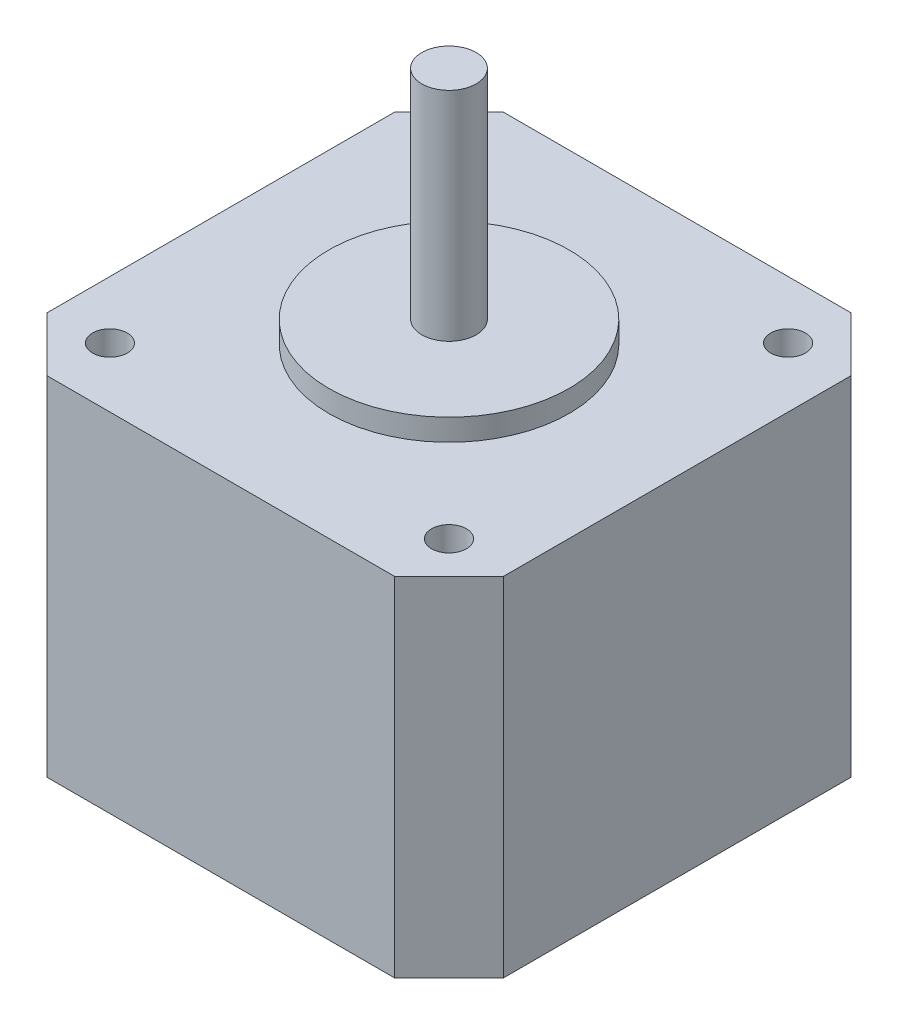
ISO-10303-21;
HEADER;
FILE_DESCRIPTION(('STEP AP214'),'2;1');
FILE_NAME('part.step','',(''),(''),'','','');
FILE_SCHEMA(('AUTOMOTIVE_DESIGN { 1 0 10303 214 1 1 1 1 }'));
ENDSEC;
DATA;
#1=APPLICATION_CONTEXT('core data for automotive mechanical design processes');
#2=APPLICATION_PROTOCOL_DEFINITION('international standard','automotive_design',2000,#1);
#3=PRODUCT_CONTEXT('',#1,'mechanical');
#4=PRODUCT('Part','Part','',(#3));
#5=PRODUCT_RELATED_PRODUCT_CATEGORY('part','',(#4));
#6=PRODUCT_DEFINITION_FORMATION('','',#4);
#7=PRODUCT_DEFINITION_CONTEXT('part definition',#1,'design');
#8=PRODUCT_DEFINITION('design','',#6,#7);
#9=PRODUCT_DEFINITION_SHAPE('','',#8);
#10=(LENGTH_UNIT() NAMED_UNIT(*) SI_UNIT(.MILLI.,.METRE.));
#11=(NAMED_UNIT(*) PLANE_ANGLE_UNIT() SI_UNIT($,.RADIAN.));
#12=(NAMED_UNIT(*) SI_UNIT($,.STERADIAN.) SOLID_ANGLE_UNIT());
#13=UNCERTAINTY_MEASURE_WITH_UNIT(LENGTH_MEASURE(1.E-05),#10,'distance_accuracy_value','');
#14=(GEOMETRIC_REPRESENTATION_CONTEXT(3) GLOBAL_UNCERTAINTY_ASSIGNED_CONTEXT((#13)) GLOBAL_UNIT_ASSIGNED_CONTEXT((#10,
#11,#12)) REPRESENTATION_CONTEXT('',''));
#15=CARTESIAN_POINT('',(0.,0.,0.));
#16=DIRECTION('',(0.,0.,1.));
#17=DIRECTION('',(1.,0.,0.));
#18=AXIS2_PLACEMENT_3D('',#15,#16,#17);
#19=CARTESIAN_POINT('',(21.,32.,21.));
#20=DIRECTION('',(-1.,0.,0.));
#21=DIRECTION('',(0.,0.,1.));
#22=AXIS2_PLACEMENT_3D('',#19,#20,#21);
#23=PLANE('',#22);
#24=DIRECTION('',(0.,0.,-1.));
#25=VECTOR('',#24,1.);
#26=CARTESIAN_POINT('',(21.,0.,21.));
#27=LINE('',#26,#25);
#28=CARTESIAN_POINT('',(21.,0.,16.));
#29=VERTEX_POINT('',#28);
#30=CARTESIAN_POINT('',(21.,0.,-16.));
#31=VERTEX_POINT('',#30);
#32=EDGE_CURVE('E134',#29,#31,#27,.T.);
#33=ORIENTED_EDGE('',*,*,#32,.T.);
#34=DIRECTION('',(0.,1.,0.));
#35=VECTOR('',#34,1.);
#36=CARTESIAN_POINT('',(21.,32.,-16.));
#37=LINE('',#36,#35);
#38=CARTESIAN_POINT('',(21.,32.,-16.));
#39=VERTEX_POINT('',#38);
#40=EDGE_CURVE('E157',#31,#39,#37,.T.);
#41=ORIENTED_EDGE('',*,*,#40,.T.);
#42=DIRECTION('',(0.,0.,-1.));
#43=VECTOR('',#42,1.);
#44=CARTESIAN_POINT('',(21.,32.,21.));
#45=LINE('',#44,#43);
#46=CARTESIAN_POINT('',(21.,32.,16.));
#47=VERTEX_POINT('',#46);
#48=EDGE_CURVE('E132',#47,#39,#45,.T.);
#49=ORIENTED_EDGE('',*,*,#48,.F.);
#50=DIRECTION('',(0.,-1.,0.));
#51=VECTOR('',#50,1.);
#52=CARTESIAN_POINT('',(21.,32.,16.));
#53=LINE('',#52,#51);
#54=EDGE_CURVE('E154',#47,#29,#53,.T.);
#55=ORIENTED_EDGE('',*,*,#54,.T.);
#56=EDGE_LOOP('',(#33,#41,#49,#55));
#57=FACE_BOUND('',#56,.T.);
#58=ADVANCED_FACE('F35',(#57),#23,.F.);
#59=CARTESIAN_POINT('',(-21.,32.,-21.));
#60=DIRECTION('',(0.,0.,1.));
#61=DIRECTION('',(1.,0.,0.));
#62=AXIS2_PLACEMENT_3D('',#59,#60,#61);
#63=PLANE('',#62);
#64=DIRECTION('',(-1.,0.,0.));
#65=VECTOR('',#64,1.);
#66=CARTESIAN_POINT('',(-21.,0.,-21.));
#67=LINE('',#66,#65);
#68=CARTESIAN_POINT('',(16.,0.,-21.));
#69=VERTEX_POINT('',#68);
#70=CARTESIAN_POINT('',(-16.,0.,-21.));
#71=VERTEX_POINT('',#70);
#72=EDGE_CURVE('E130',#69,#71,#67,.T.);
#73=ORIENTED_EDGE('',*,*,#72,.T.);
#74=DIRECTION('',(0.,1.,0.));
#75=VECTOR('',#74,1.);
#76=CARTESIAN_POINT('',(-16.,32.,-21.));
#77=LINE('',#76,#75);
#78=CARTESIAN_POINT('',(-16.,32.,-21.));
#79=VERTEX_POINT('',#78);
#80=EDGE_CURVE('E109',#71,#79,#77,.T.);
#81=ORIENTED_EDGE('',*,*,#80,.T.);
#82=DIRECTION('',(-1.,0.,0.));
#83=VECTOR('',#82,1.);
#84=CARTESIAN_POINT('',(-21.,32.,-21.));
#85=LINE('',#84,#83);
#86=CARTESIAN_POINT('',(16.,32.,-21.));
#87=VERTEX_POINT('',#86);
#88=EDGE_CURVE('E170',#87,#79,#85,.T.);
#89=ORIENTED_EDGE('',*,*,#88,.F.);
#90=DIRECTION('',(0.,-1.,0.));
#91=VECTOR('',#90,1.);
#92=CARTESIAN_POINT('',(16.,32.,-21.));
#93=LINE('',#92,#91);
#94=EDGE_CURVE('E114',#87,#69,#93,.T.);
#95=ORIENTED_EDGE('',*,*,#94,.T.);
#96=EDGE_LOOP('',(#73,#81,#89,#95));
#97=FACE_BOUND('',#96,.T.);
#98=ADVANCED_FACE('F233',(#97),#63,.F.);
#99=CARTESIAN_POINT('',(-21.,32.,21.));
#100=DIRECTION('',(1.,0.,0.));
#101=DIRECTION('',(0.,0.,-1.));
#102=AXIS2_PLACEMENT_3D('',#99,#100,#101);
#103=PLANE('',#102);
#104=DIRECTION('',(0.,0.,1.));
#105=VECTOR('',#104,1.);
#106=CARTESIAN_POINT('',(-21.,32.,21.));
#107=LINE('',#106,#105);
#108=CARTESIAN_POINT('',(-21.,32.,-16.));
#109=VERTEX_POINT('',#108);
#110=CARTESIAN_POINT('',(-21.,32.,16.));
#111=VERTEX_POINT('',#110);
#112=EDGE_CURVE('E123',#109,#111,#107,.T.);
#113=ORIENTED_EDGE('',*,*,#112,.F.);
#114=DIRECTION('',(0.,-1.,0.));
#115=VECTOR('',#114,1.);
#116=CARTESIAN_POINT('',(-21.,32.,-16.));
#117=LINE('',#116,#115);
#118=CARTESIAN_POINT('',(-21.,0.,-16.));
#119=VERTEX_POINT('',#118);
#120=EDGE_CURVE('E108',#109,#119,#117,.T.);
#121=ORIENTED_EDGE('',*,*,#120,.T.);
#122=DIRECTION('',(0.,0.,1.));
#123=VECTOR('',#122,1.);
#124=CARTESIAN_POINT('',(-21.,0.,21.));
#125=LINE('',#124,#123);
#126=CARTESIAN_POINT('',(-21.,0.,16.));
#127=VERTEX_POINT('',#126);
#128=EDGE_CURVE('E121',#119,#127,#125,.T.);
#129=ORIENTED_EDGE('',*,*,#128,.T.);
#130=DIRECTION('',(0.,1.,0.));
#131=VECTOR('',#130,1.);
#132=CARTESIAN_POINT('',(-21.,32.,16.));
#133=LINE('',#132,#131);
#134=EDGE_CURVE('E125',#127,#111,#133,.T.);
#135=ORIENTED_EDGE('',*,*,#134,.T.);
#136=EDGE_LOOP('',(#113,#121,#129,#135));
#137=FACE_BOUND('',#136,.T.);
#138=ADVANCED_FACE('F120',(#137),#103,.F.);
#139=CARTESIAN_POINT('',(-21.,32.,21.));
#140=DIRECTION('',(0.,0.,-1.));
#141=DIRECTION('',(-1.,0.,0.));
#142=AXIS2_PLACEMENT_3D('',#139,#140,#141);
#143=PLANE('',#142);
#144=DIRECTION('',(1.,0.,0.));
#145=VECTOR('',#144,1.);
#146=CARTESIAN_POINT('',(-21.,0.,21.));
#147=LINE('',#146,#145);
#148=CARTESIAN_POINT('',(-16.,0.,21.));
#149=VERTEX_POINT('',#148);
#150=CARTESIAN_POINT('',(16.,0.,21.));
#151=VERTEX_POINT('',#150);
#152=EDGE_CURVE('E129',#149,#151,#147,.T.);
#153=ORIENTED_EDGE('',*,*,#152,.T.);
#154=DIRECTION('',(0.,1.,0.));
#155=VECTOR('',#154,1.);
#156=CARTESIAN_POINT('',(16.,32.,21.));
#157=LINE('',#156,#155);
#158=CARTESIAN_POINT('',(16.,32.,21.));
#159=VERTEX_POINT('',#158);
#160=EDGE_CURVE('E40',#151,#159,#157,.T.);
#161=ORIENTED_EDGE('',*,*,#160,.T.);
#162=DIRECTION('',(1.,0.,0.));
#163=VECTOR('',#162,1.);
#164=CARTESIAN_POINT('',(-21.,32.,21.));
#165=LINE('',#164,#163);
#166=CARTESIAN_POINT('',(-16.,32.,21.));
#167=VERTEX_POINT('',#166);
#168=EDGE_CURVE('E138',#167,#159,#165,.T.);
#169=ORIENTED_EDGE('',*,*,#168,.F.);
#170=DIRECTION('',(0.,-1.,0.));
#171=VECTOR('',#170,1.);
#172=CARTESIAN_POINT('',(-16.,32.,21.));
#173=LINE('',#172,#171);
#174=EDGE_CURVE('E158',#167,#149,#173,.T.);
#175=ORIENTED_EDGE('',*,*,#174,.T.);
#176=EDGE_LOOP('',(#153,#161,#169,#175));
#177=FACE_BOUND('',#176,.T.);
#178=ADVANCED_FACE('F224',(#177),#143,.F.);
#179=CARTESIAN_POINT('',(0.,32.,0.));
#180=DIRECTION('',(0.,-1.,0.));
#181=DIRECTION('',(0.,0.,-1.));
#182=AXIS2_PLACEMENT_3D('',#179,#180,#181);
#183=PLANE('',#182);
#184=CARTESIAN_POINT('',(-15.6999999999997,32.,15.5));
#185=DIRECTION('',(0.,1.,0.));
#186=DIRECTION('',(0.,0.,1.));
#187=AXIS2_PLACEMENT_3D('',#184,#185,#186);
#188=CIRCLE('',#187,1.6);
#189=CARTESIAN_POINT('',(-15.6999999999997,32.,17.1));
#190=VERTEX_POINT('',#189);
#191=EDGE_CURVE('E194',#190,#190,#188,.T.);
#192=ORIENTED_EDGE('',*,*,#191,.F.);
#193=EDGE_LOOP('',(#192));
#194=FACE_BOUND('',#193,.T.);
#195=CARTESIAN_POINT('',(15.5000000000003,32.,15.5));
#196=DIRECTION('',(0.,1.,0.));
#197=DIRECTION('',(0.,0.,1.));
#198=AXIS2_PLACEMENT_3D('',#195,#196,#197);
#199=CIRCLE('',#198,1.6);
#200=CARTESIAN_POINT('',(15.5000000000003,32.,17.1));
#201=VERTEX_POINT('',#200);
#202=EDGE_CURVE('E200',#201,#201,#199,.T.);
#203=ORIENTED_EDGE('',*,*,#202,.F.);
#204=EDGE_LOOP('',(#203));
#205=FACE_BOUND('',#204,.T.);
#206=CARTESIAN_POINT('',(15.5,32.,-15.7));
#207=DIRECTION('',(0.,1.,0.));
#208=DIRECTION('',(0.,0.,1.));
#209=AXIS2_PLACEMENT_3D('',#206,#207,#208);
#210=CIRCLE('',#209,1.6);
#211=CARTESIAN_POINT('',(15.5,32.,-14.1));
#212=VERTEX_POINT('',#211);
#213=EDGE_CURVE('E206',#212,#212,#210,.T.);
#214=ORIENTED_EDGE('',*,*,#213,.F.);
#215=EDGE_LOOP('',(#214));
#216=FACE_BOUND('',#215,.T.);
#217=CARTESIAN_POINT('',(-15.7,32.,-15.7));
#218=DIRECTION('',(0.,1.,0.));
#219=DIRECTION('',(0.,0.,1.));
#220=AXIS2_PLACEMENT_3D('',#217,#218,#219);
#221=CIRCLE('',#220,1.6);
#222=CARTESIAN_POINT('',(-15.7,32.,-14.1));
#223=VERTEX_POINT('',#222);
#224=EDGE_CURVE('E188',#223,#223,#221,.T.);
#225=ORIENTED_EDGE('',*,*,#224,.F.);
#226=EDGE_LOOP('',(#225));
#227=FACE_BOUND('',#226,.T.);
#228=CARTESIAN_POINT('',(0.,32.,0.));
#229=DIRECTION('',(0.,1.,0.));
#230=DIRECTION('',(0.,0.,1.));
#231=AXIS2_PLACEMENT_3D('',#228,#229,#230);
#232=CIRCLE('',#231,11.05);
#233=CARTESIAN_POINT('',(0.,32.,11.05));
#234=VERTEX_POINT('',#233);
#235=EDGE_CURVE('E45',#234,#234,#232,.T.);
#236=ORIENTED_EDGE('',*,*,#235,.F.);
#237=EDGE_LOOP('',(#236));
#238=FACE_BOUND('',#237,.T.);
#239=ORIENTED_EDGE('',*,*,#88,.T.);
#240=DIRECTION('',(0.707106781186549,0.,-0.707106781186547));
#241=VECTOR('',#240,1.);
#242=CARTESIAN_POINT('',(-21.,32.,-16.));
#243=LINE('',#242,#241);
#244=EDGE_CURVE('E152',#79,#109,#243,.F.);
#245=ORIENTED_EDGE('',*,*,#244,.T.);
#246=ORIENTED_EDGE('',*,*,#112,.T.);
#247=DIRECTION('',(-0.707106781186546,0.,-0.707106781186549));
#248=VECTOR('',#247,1.);
#249=CARTESIAN_POINT('',(-16.,32.,21.));
#250=LINE('',#249,#248);
#251=EDGE_CURVE('E59',#111,#167,#250,.F.);
#252=ORIENTED_EDGE('',*,*,#251,.T.);
#253=ORIENTED_EDGE('',*,*,#168,.T.);
#254=DIRECTION('',(-0.707106781186549,0.,0.707106781186547));
#255=VECTOR('',#254,1.);
#256=CARTESIAN_POINT('',(21.,32.,16.));
#257=LINE('',#256,#255);
#258=EDGE_CURVE('E148',#159,#47,#257,.F.);
#259=ORIENTED_EDGE('',*,*,#258,.T.);
#260=ORIENTED_EDGE('',*,*,#48,.T.);
#261=DIRECTION('',(0.707106781186546,0.,0.707106781186549));
#262=VECTOR('',#261,1.);
#263=CARTESIAN_POINT('',(16.,32.,-21.));
#264=LINE('',#263,#262);
#265=EDGE_CURVE('E150',#39,#87,#264,.F.);
#266=ORIENTED_EDGE('',*,*,#265,.T.);
#267=EDGE_LOOP('',(#239,#245,#246,#252,#253,#259,#260,#266));
#268=FACE_BOUND('',#267,.T.);
#269=ADVANCED_FACE('F221',(#194,#205,#216,#227,#238,#268),#183,.F.);
#270=CARTESIAN_POINT('',(0.,0.,0.));
#271=DIRECTION('',(0.,-1.,0.));
#272=DIRECTION('',(0.,0.,-1.));
#273=AXIS2_PLACEMENT_3D('',#270,#271,#272);
#274=PLANE('',#273);
#275=ORIENTED_EDGE('',*,*,#128,.F.);
#276=DIRECTION('',(-0.707106781186549,0.,0.707106781186547));
#277=VECTOR('',#276,1.);
#278=CARTESIAN_POINT('',(-18.5,0.,-18.5));
#279=LINE('',#278,#277);
#280=EDGE_CURVE('E104',#119,#71,#279,.F.);
#281=ORIENTED_EDGE('',*,*,#280,.T.);
#282=ORIENTED_EDGE('',*,*,#72,.F.);
#283=DIRECTION('',(-0.707106781186546,0.,-0.707106781186549));
#284=VECTOR('',#283,1.);
#285=CARTESIAN_POINT('',(18.5,0.,-18.5));
#286=LINE('',#285,#284);
#287=EDGE_CURVE('E115',#69,#31,#286,.F.);
#288=ORIENTED_EDGE('',*,*,#287,.T.);
#289=ORIENTED_EDGE('',*,*,#32,.F.);
#290=DIRECTION('',(0.707106781186549,0.,-0.707106781186547));
#291=VECTOR('',#290,1.);
#292=CARTESIAN_POINT('',(18.5,0.,18.5));
#293=LINE('',#292,#291);
#294=EDGE_CURVE('E141',#29,#151,#293,.F.);
#295=ORIENTED_EDGE('',*,*,#294,.T.);
#296=ORIENTED_EDGE('',*,*,#152,.F.);
#297=DIRECTION('',(0.707106781186546,0.,0.707106781186549));
#298=VECTOR('',#297,1.);
#299=CARTESIAN_POINT('',(-18.5,0.,18.5));
#300=LINE('',#299,#298);
#301=EDGE_CURVE('E124',#149,#127,#300,.F.);
#302=ORIENTED_EDGE('',*,*,#301,.T.);
#303=EDGE_LOOP('',(#275,#281,#282,#288,#289,#295,#296,#302));
#304=FACE_BOUND('',#303,.T.);
#305=ADVANCED_FACE('F127',(#304),#274,.T.);
#306=CARTESIAN_POINT('',(-21.,32.,-16.));
#307=DIRECTION('',(0.707106781186547,0.,0.707106781186549));
#308=DIRECTION('',(0.,-1.,0.));
#309=AXIS2_PLACEMENT_3D('',#306,#307,#308);
#310=PLANE('',#309);
#311=ORIENTED_EDGE('',*,*,#244,.F.);
#312=ORIENTED_EDGE('',*,*,#80,.F.);
#313=ORIENTED_EDGE('',*,*,#280,.F.);
#314=ORIENTED_EDGE('',*,*,#120,.F.);
#315=EDGE_LOOP('',(#311,#312,#313,#314));
#316=FACE_BOUND('',#315,.T.);
#317=ADVANCED_FACE('F107',(#316),#310,.F.);
#318=CARTESIAN_POINT('',(16.,32.,-21.));
#319=DIRECTION('',(-0.707106781186549,0.,0.707106781186546));
#320=DIRECTION('',(0.,-1.,0.));
#321=AXIS2_PLACEMENT_3D('',#318,#319,#320);
#322=PLANE('',#321);
#323=ORIENTED_EDGE('',*,*,#265,.F.);
#324=ORIENTED_EDGE('',*,*,#40,.F.);
#325=ORIENTED_EDGE('',*,*,#287,.F.);
#326=ORIENTED_EDGE('',*,*,#94,.F.);
#327=EDGE_LOOP('',(#323,#324,#325,#326));
#328=FACE_BOUND('',#327,.T.);
#329=ADVANCED_FACE('F235',(#328),#322,.F.);
#330=CARTESIAN_POINT('',(21.,32.,16.));
#331=DIRECTION('',(-0.707106781186546,0.,-0.707106781186548));
#332=DIRECTION('',(0.,-1.,0.));
#333=AXIS2_PLACEMENT_3D('',#330,#331,#332);
#334=PLANE('',#333);
#335=ORIENTED_EDGE('',*,*,#258,.F.);
#336=ORIENTED_EDGE('',*,*,#160,.F.);
#337=ORIENTED_EDGE('',*,*,#294,.F.);
#338=ORIENTED_EDGE('',*,*,#54,.F.);
#339=EDGE_LOOP('',(#335,#336,#337,#338));
#340=FACE_BOUND('',#339,.T.);
#341=ADVANCED_FACE('F239',(#340),#334,.F.);
#342=CARTESIAN_POINT('',(-16.,32.,21.));
#343=DIRECTION('',(0.707106781186549,0.,-0.707106781186546));
#344=DIRECTION('',(0.,-1.,0.));
#345=AXIS2_PLACEMENT_3D('',#342,#343,#344);
#346=PLANE('',#345);
#347=ORIENTED_EDGE('',*,*,#251,.F.);
#348=ORIENTED_EDGE('',*,*,#134,.F.);
#349=ORIENTED_EDGE('',*,*,#301,.F.);
#350=ORIENTED_EDGE('',*,*,#174,.F.);
#351=EDGE_LOOP('',(#347,#348,#349,#350));
#352=FACE_BOUND('',#351,.T.);
#353=ADVANCED_FACE('F38',(#352),#346,.F.);
#354=CARTESIAN_POINT('',(0.,34.,0.));
#355=DIRECTION('',(0.,-1.,0.));
#356=DIRECTION('',(0.,0.,-1.));
#357=AXIS2_PLACEMENT_3D('',#354,#355,#356);
#358=CYLINDRICAL_SURFACE('',#357,11.05);
#359=CARTESIAN_POINT('',(0.,34.,0.));
#360=DIRECTION('',(0.,1.,0.));
#361=DIRECTION('',(0.,0.,1.));
#362=AXIS2_PLACEMENT_3D('',#359,#360,#361);
#363=CIRCLE('',#362,11.05);
#364=CARTESIAN_POINT('',(0.,34.,11.05));
#365=VERTEX_POINT('',#364);
#366=EDGE_CURVE('E167',#365,#365,#363,.T.);
#367=ORIENTED_EDGE('',*,*,#366,.F.);
#368=EDGE_LOOP('',(#367));
#369=FACE_BOUND('',#368,.T.);
#370=ORIENTED_EDGE('',*,*,#235,.T.);
#371=EDGE_LOOP('',(#370));
#372=FACE_BOUND('',#371,.T.);
#373=ADVANCED_FACE('F265',(#369,#372),#358,.T.);
#374=CARTESIAN_POINT('',(0.,34.,0.));
#375=DIRECTION('',(0.,1.,0.));
#376=DIRECTION('',(0.,0.,1.));
#377=AXIS2_PLACEMENT_3D('',#374,#375,#376);
#378=PLANE('',#377);
#379=CARTESIAN_POINT('',(0.,34.,0.));
#380=DIRECTION('',(0.,1.,0.));
#381=DIRECTION('',(0.,0.,1.));
#382=AXIS2_PLACEMENT_3D('',#379,#380,#381);
#383=CIRCLE('',#382,2.5);
#384=CARTESIAN_POINT('',(0.,34.,2.5));
#385=VERTEX_POINT('',#384);
#386=EDGE_CURVE('E11',#385,#385,#383,.T.);
#387=ORIENTED_EDGE('',*,*,#386,.F.);
#388=EDGE_LOOP('',(#387));
#389=FACE_BOUND('',#388,.T.);
#390=ORIENTED_EDGE('',*,*,#366,.T.);
#391=EDGE_LOOP('',(#390));
#392=FACE_BOUND('',#391,.T.);
#393=ADVANCED_FACE('F270',(#389,#392),#378,.T.);
#394=CARTESIAN_POINT('',(0.,54.,0.));
#395=DIRECTION('',(0.,-1.,0.));
#396=DIRECTION('',(0.,0.,-1.));
#397=AXIS2_PLACEMENT_3D('',#394,#395,#396);
#398=CYLINDRICAL_SURFACE('',#397,2.5);
#399=CARTESIAN_POINT('',(0.,54.,0.));
#400=DIRECTION('',(0.,1.,0.));
#401=DIRECTION('',(0.,0.,1.));
#402=AXIS2_PLACEMENT_3D('',#399,#400,#401);
#403=CIRCLE('',#402,2.5);
#404=CARTESIAN_POINT('',(0.,54.,2.5));
#405=VERTEX_POINT('',#404);
#406=EDGE_CURVE('E179',#405,#405,#403,.T.);
#407=ORIENTED_EDGE('',*,*,#406,.F.);
#408=EDGE_LOOP('',(#407));
#409=FACE_BOUND('',#408,.T.);
#410=ORIENTED_EDGE('',*,*,#386,.T.);
#411=EDGE_LOOP('',(#410));
#412=FACE_BOUND('',#411,.T.);
#413=ADVANCED_FACE('F276',(#409,#412),#398,.T.);
#414=CARTESIAN_POINT('',(0.,54.,0.));
#415=DIRECTION('',(0.,1.,0.));
#416=DIRECTION('',(0.,0.,1.));
#417=AXIS2_PLACEMENT_3D('',#414,#415,#416);
#418=PLANE('',#417);
#419=ORIENTED_EDGE('',*,*,#406,.T.);
#420=EDGE_LOOP('',(#419));
#421=FACE_BOUND('',#420,.T.);
#422=ADVANCED_FACE('F339',(#421),#418,.T.);
#423=CARTESIAN_POINT('',(-15.7,27.,-15.7));
#424=DIRECTION('',(0.,1.,0.));
#425=DIRECTION('',(0.,0.,1.));
#426=AXIS2_PLACEMENT_3D('',#423,#424,#425);
#427=CYLINDRICAL_SURFACE('',#426,1.6);
#428=CARTESIAN_POINT('',(-15.7,27.,-15.7));
#429=DIRECTION('',(0.,1.,0.));
#430=DIRECTION('',(0.,0.,1.));
#431=AXIS2_PLACEMENT_3D('',#428,#429,#430);
#432=CIRCLE('',#431,1.6);
#433=CARTESIAN_POINT('',(-15.7,27.,-14.1));
#434=VERTEX_POINT('',#433);
#435=EDGE_CURVE('E183',#434,#434,#432,.T.);
#436=ORIENTED_EDGE('',*,*,#435,.F.);
#437=EDGE_LOOP('',(#436));
#438=FACE_BOUND('',#437,.T.);
#439=ORIENTED_EDGE('',*,*,#224,.T.);
#440=EDGE_LOOP('',(#439));
#441=FACE_BOUND('',#440,.T.);
#442=ADVANCED_FACE('F347',(#438,#441),#427,.F.);
#443=CARTESIAN_POINT('',(-15.7,27.,-15.7));
#444=DIRECTION('',(0.,1.,0.));
#445=DIRECTION('',(0.,0.,1.));
#446=AXIS2_PLACEMENT_3D('',#443,#444,#445);
#447=PLANE('',#446);
#448=ORIENTED_EDGE('',*,*,#435,.T.);
#449=EDGE_LOOP('',(#448));
#450=FACE_BOUND('',#449,.T.);
#451=ADVANCED_FACE('F217',(#450),#447,.T.);
#452=CARTESIAN_POINT('',(15.5,27.,-15.7));
#453=DIRECTION('',(0.,1.,0.));
#454=DIRECTION('',(0.,0.,1.));
#455=AXIS2_PLACEMENT_3D('',#452,#453,#454);
#456=CYLINDRICAL_SURFACE('',#455,1.6);
#457=CARTESIAN_POINT('',(15.5,27.,-15.7));
#458=DIRECTION('',(0.,1.,0.));
#459=DIRECTION('',(0.,0.,1.));
#460=AXIS2_PLACEMENT_3D('',#457,#458,#459);
#461=CIRCLE('',#460,1.6);
#462=CARTESIAN_POINT('',(15.5,27.,-14.1));
#463=VERTEX_POINT('',#462);
#464=EDGE_CURVE('E192',#463,#463,#461,.T.);
#465=ORIENTED_EDGE('',*,*,#464,.F.);
#466=EDGE_LOOP('',(#465));
#467=FACE_BOUND('',#466,.T.);
#468=ORIENTED_EDGE('',*,*,#213,.T.);
#469=EDGE_LOOP('',(#468));
#470=FACE_BOUND('',#469,.T.);
#471=ADVANCED_FACE('F214',(#467,#470),#456,.F.);
#472=CARTESIAN_POINT('',(15.5,27.,-15.7));
#473=DIRECTION('',(0.,1.,0.));
#474=DIRECTION('',(0.,0.,1.));
#475=AXIS2_PLACEMENT_3D('',#472,#473,#474);
#476=PLANE('',#475);
#477=ORIENTED_EDGE('',*,*,#464,.T.);
#478=EDGE_LOOP('',(#477));
#479=FACE_BOUND('',#478,.T.);
#480=ADVANCED_FACE('F212',(#479),#476,.T.);
#481=CARTESIAN_POINT('',(15.5000000000003,27.,15.5));
#482=DIRECTION('',(0.,1.,0.));
#483=DIRECTION('',(0.,0.,1.));
#484=AXIS2_PLACEMENT_3D('',#481,#482,#483);
#485=CYLINDRICAL_SURFACE('',#484,1.6);
#486=CARTESIAN_POINT('',(15.5000000000003,27.,15.5));
#487=DIRECTION('',(0.,1.,0.));
#488=DIRECTION('',(0.,0.,1.));
#489=AXIS2_PLACEMENT_3D('',#486,#487,#488);
#490=CIRCLE('',#489,1.6);
#491=CARTESIAN_POINT('',(15.5000000000003,27.,17.1));
#492=VERTEX_POINT('',#491);
#493=EDGE_CURVE('E203',#492,#492,#490,.T.);
#494=ORIENTED_EDGE('',*,*,#493,.F.);
#495=EDGE_LOOP('',(#494));
#496=FACE_BOUND('',#495,.T.);
#497=ORIENTED_EDGE('',*,*,#202,.T.);
#498=EDGE_LOOP('',(#497));
#499=FACE_BOUND('',#498,.T.);
#500=ADVANCED_FACE('F373',(#496,#499),#485,.F.);
#501=CARTESIAN_POINT('',(15.5000000000003,27.,15.5));
#502=DIRECTION('',(0.,1.,0.));
#503=DIRECTION('',(0.,0.,1.));
#504=AXIS2_PLACEMENT_3D('',#501,#502,#503);
#505=PLANE('',#504);
#506=ORIENTED_EDGE('',*,*,#493,.T.);
#507=EDGE_LOOP('',(#506));
#508=FACE_BOUND('',#507,.T.);
#509=ADVANCED_FACE('F380',(#508),#505,.T.);
#510=CARTESIAN_POINT('',(-15.6999999999997,27.,15.5));
#511=DIRECTION('',(0.,1.,0.));
#512=DIRECTION('',(0.,0.,1.));
#513=AXIS2_PLACEMENT_3D('',#510,#511,#512);
#514=CYLINDRICAL_SURFACE('',#513,1.6);
#515=CARTESIAN_POINT('',(-15.6999999999997,27.,15.5));
#516=DIRECTION('',(0.,1.,0.));
#517=DIRECTION('',(0.,0.,1.));
#518=AXIS2_PLACEMENT_3D('',#515,#516,#517);
#519=CIRCLE('',#518,1.6);
#520=CARTESIAN_POINT('',(-15.6999999999997,27.,17.1));
#521=VERTEX_POINT('',#520);
#522=EDGE_CURVE('E197',#521,#521,#519,.T.);
#523=ORIENTED_EDGE('',*,*,#522,.F.);
#524=EDGE_LOOP('',(#523));
#525=FACE_BOUND('',#524,.T.);
#526=ORIENTED_EDGE('',*,*,#191,.T.);
#527=EDGE_LOOP('',(#526));
#528=FACE_BOUND('',#527,.T.);
#529=ADVANCED_FACE('F388',(#525,#528),#514,.F.);
#530=CARTESIAN_POINT('',(-15.6999999999997,27.,15.5));
#531=DIRECTION('',(0.,1.,0.));
#532=DIRECTION('',(0.,0.,1.));
#533=AXIS2_PLACEMENT_3D('',#530,#531,#532);
#534=PLANE('',#533);
#535=ORIENTED_EDGE('',*,*,#522,.T.);
#536=EDGE_LOOP('',(#535));
#537=FACE_BOUND('',#536,.T.);
#538=ADVANCED_FACE('F396',(#537),#534,.T.);
#539=CLOSED_SHELL('',(#58,#98,#138,#178,#269,#305,#317,#329,#341,#353,#373,#393,#413,#422,#442,
#451,#471,#480,#500,#509,#529,#538));
#540=MANIFOLD_SOLID_BREP('B2',#539);
#541=ADVANCED_BREP_SHAPE_REPRESENTATION('',(#18,#540),#14);
#542=SHAPE_DEFINITION_REPRESENTATION(#9,#541);
ENDSEC;
END-ISO-10303-21;
